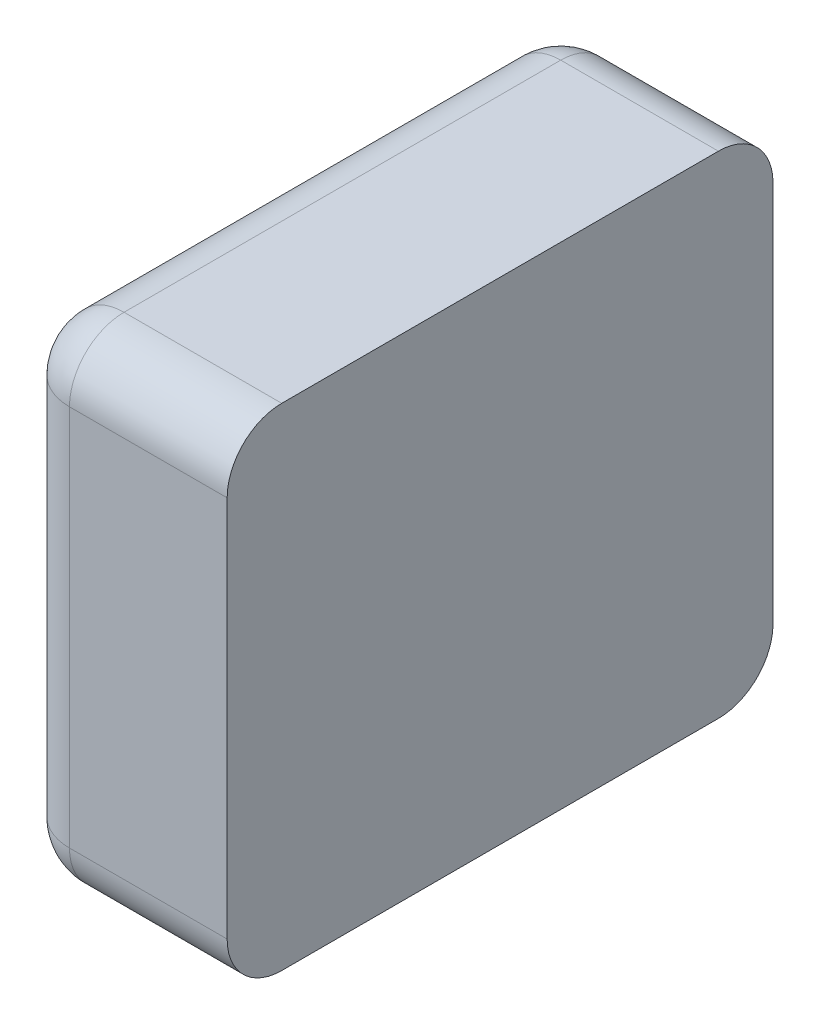
ISO-10303-21;
HEADER;
FILE_DESCRIPTION(('STEP AP214'),'2;1');
FILE_NAME('part.step','',(''),(''),'','','');
FILE_SCHEMA(('AUTOMOTIVE_DESIGN { 1 0 10303 214 1 1 1 1 }'));
ENDSEC;
DATA;
#1=APPLICATION_CONTEXT('core data for automotive mechanical design processes');
#2=APPLICATION_PROTOCOL_DEFINITION('international standard','automotive_design',2000,#1);
#3=PRODUCT_CONTEXT('',#1,'mechanical');
#4=PRODUCT('Part','Part','',(#3));
#5=PRODUCT_RELATED_PRODUCT_CATEGORY('part','',(#4));
#6=PRODUCT_DEFINITION_FORMATION('','',#4);
#7=PRODUCT_DEFINITION_CONTEXT('part definition',#1,'design');
#8=PRODUCT_DEFINITION('design','',#6,#7);
#9=PRODUCT_DEFINITION_SHAPE('','',#8);
#10=(LENGTH_UNIT() NAMED_UNIT(*) SI_UNIT(.MILLI.,.METRE.));
#11=(NAMED_UNIT(*) PLANE_ANGLE_UNIT() SI_UNIT($,.RADIAN.));
#12=(NAMED_UNIT(*) SI_UNIT($,.STERADIAN.) SOLID_ANGLE_UNIT());
#13=UNCERTAINTY_MEASURE_WITH_UNIT(LENGTH_MEASURE(1.E-05),#10,'distance_accuracy_value','');
#14=(GEOMETRIC_REPRESENTATION_CONTEXT(3) GLOBAL_UNCERTAINTY_ASSIGNED_CONTEXT((#13)) GLOBAL_UNIT_ASSIGNED_CONTEXT((#10,
#11,#12)) REPRESENTATION_CONTEXT('',''));
#15=CARTESIAN_POINT('',(0.,0.,0.));
#16=DIRECTION('',(0.,0.,1.));
#17=DIRECTION('',(1.,0.,0.));
#18=AXIS2_PLACEMENT_3D('',#15,#16,#17);
#19=CARTESIAN_POINT('',(-0.8,-0.405,0.));
#20=DIRECTION('',(1.,0.,0.));
#21=DIRECTION('',(0.,0.,1.));
#22=AXIS2_PLACEMENT_3D('',#19,#20,#21);
#23=PLANE('',#22);
#24=DIRECTION('',(0.,1.,0.));
#25=VECTOR('',#24,1.);
#26=CARTESIAN_POINT('',(-0.8,-0.405,0.81));
#27=LINE('',#26,#25);
#28=CARTESIAN_POINT('',(-0.8,-0.315,0.81));
#29=VERTEX_POINT('',#28);
#30=CARTESIAN_POINT('',(-0.8,0.315,0.81));
#31=VERTEX_POINT('',#30);
#32=EDGE_CURVE('E11',#29,#31,#27,.T.);
#33=ORIENTED_EDGE('',*,*,#32,.T.);
#34=DIRECTION('',(0.,0.,1.));
#35=VECTOR('',#34,1.);
#36=CARTESIAN_POINT('',(-0.8,0.315,0.));
#37=LINE('',#36,#35);
#38=CARTESIAN_POINT('',(-0.8,0.315,0.09));
#39=VERTEX_POINT('',#38);
#40=EDGE_CURVE('E24',#39,#31,#37,.T.);
#41=ORIENTED_EDGE('',*,*,#40,.F.);
#42=DIRECTION('',(0.,1.,0.));
#43=VECTOR('',#42,1.);
#44=CARTESIAN_POINT('',(-0.8,-0.405,0.09));
#45=LINE('',#44,#43);
#46=CARTESIAN_POINT('',(-0.8,-0.315,0.09));
#47=VERTEX_POINT('',#46);
#48=EDGE_CURVE('E192',#47,#39,#45,.T.);
#49=ORIENTED_EDGE('',*,*,#48,.F.);
#50=DIRECTION('',(0.,0.,1.));
#51=VECTOR('',#50,1.);
#52=CARTESIAN_POINT('',(-0.8,-0.315,0.));
#53=LINE('',#52,#51);
#54=EDGE_CURVE('E36',#47,#29,#53,.T.);
#55=ORIENTED_EDGE('',*,*,#54,.T.);
#56=EDGE_LOOP('',(#33,#41,#49,#55));
#57=FACE_BOUND('',#56,.T.);
#58=ADVANCED_FACE('F17',(#57),#23,.F.);
#59=CARTESIAN_POINT('',(-0.71,-0.315,0.));
#60=DIRECTION('',(0.,0.,1.));
#61=DIRECTION('',(-1.,0.,0.));
#62=AXIS2_PLACEMENT_3D('',#59,#60,#61);
#63=CYLINDRICAL_SURFACE('',#62,0.09);
#64=ORIENTED_EDGE('',*,*,#54,.F.);
#65=CARTESIAN_POINT('',(-0.71,-0.315,0.09));
#66=DIRECTION('',(0.,0.,1.));
#67=DIRECTION('',(-1.,0.,0.));
#68=AXIS2_PLACEMENT_3D('',#65,#66,#67);
#69=CIRCLE('',#68,0.09);
#70=CARTESIAN_POINT('',(-0.71,-0.405,0.09));
#71=VERTEX_POINT('',#70);
#72=EDGE_CURVE('E189',#47,#71,#69,.T.);
#73=ORIENTED_EDGE('',*,*,#72,.T.);
#74=DIRECTION('',(0.,0.,1.));
#75=VECTOR('',#74,1.);
#76=CARTESIAN_POINT('',(-0.71,-0.405,0.));
#77=LINE('',#76,#75);
#78=CARTESIAN_POINT('',(-0.71,-0.405,0.81));
#79=VERTEX_POINT('',#78);
#80=EDGE_CURVE('E187',#71,#79,#77,.T.);
#81=ORIENTED_EDGE('',*,*,#80,.T.);
#82=CARTESIAN_POINT('',(-0.71,-0.315,0.81));
#83=DIRECTION('',(0.,0.,1.));
#84=DIRECTION('',(-1.,0.,0.));
#85=AXIS2_PLACEMENT_3D('',#82,#83,#84);
#86=CIRCLE('',#85,0.09);
#87=EDGE_CURVE('E184',#29,#79,#86,.T.);
#88=ORIENTED_EDGE('',*,*,#87,.F.);
#89=EDGE_LOOP('',(#64,#73,#81,#88));
#90=FACE_BOUND('',#89,.T.);
#91=ADVANCED_FACE('F238',(#90),#63,.T.);
#92=CARTESIAN_POINT('',(-0.71,-0.405,0.09));
#93=DIRECTION('',(0.,1.,0.));
#94=DIRECTION('',(-1.,0.,0.));
#95=AXIS2_PLACEMENT_3D('',#92,#93,#94);
#96=CYLINDRICAL_SURFACE('',#95,0.09);
#97=ORIENTED_EDGE('',*,*,#48,.T.);
#98=CARTESIAN_POINT('',(-0.71,0.315,0.09));
#99=DIRECTION('',(0.,1.,0.));
#100=DIRECTION('',(-1.,0.,0.));
#101=AXIS2_PLACEMENT_3D('',#98,#99,#100);
#102=CIRCLE('',#101,0.09);
#103=CARTESIAN_POINT('',(-0.71,0.315,0.));
#104=VERTEX_POINT('',#103);
#105=EDGE_CURVE('E181',#104,#39,#102,.T.);
#106=ORIENTED_EDGE('',*,*,#105,.F.);
#107=DIRECTION('',(0.,1.,0.));
#108=VECTOR('',#107,1.);
#109=CARTESIAN_POINT('',(-0.71,-0.405,0.));
#110=LINE('',#109,#108);
#111=CARTESIAN_POINT('',(-0.71,-0.315,0.));
#112=VERTEX_POINT('',#111);
#113=EDGE_CURVE('E178',#112,#104,#110,.T.);
#114=ORIENTED_EDGE('',*,*,#113,.F.);
#115=CARTESIAN_POINT('',(-0.71,-0.315,0.09));
#116=DIRECTION('',(0.,1.,0.));
#117=DIRECTION('',(-1.,0.,0.));
#118=AXIS2_PLACEMENT_3D('',#115,#116,#117);
#119=CIRCLE('',#118,0.09);
#120=EDGE_CURVE('E175',#112,#47,#119,.T.);
#121=ORIENTED_EDGE('',*,*,#120,.T.);
#122=EDGE_LOOP('',(#97,#106,#114,#121));
#123=FACE_BOUND('',#122,.T.);
#124=ADVANCED_FACE('F194',(#123),#96,.T.);
#125=CARTESIAN_POINT('',(-0.71,-0.405,0.81));
#126=DIRECTION('',(0.,1.,0.));
#127=DIRECTION('',(-1.,0.,0.));
#128=AXIS2_PLACEMENT_3D('',#125,#126,#127);
#129=CYLINDRICAL_SURFACE('',#128,0.09);
#130=CARTESIAN_POINT('',(-0.71,-0.315,0.81));
#131=DIRECTION('',(0.,-1.,0.));
#132=DIRECTION('',(-1.,0.,0.));
#133=AXIS2_PLACEMENT_3D('',#130,#131,#132);
#134=CIRCLE('',#133,0.09);
#135=CARTESIAN_POINT('',(-0.71,-0.315,0.9));
#136=VERTEX_POINT('',#135);
#137=EDGE_CURVE('E172',#136,#29,#134,.T.);
#138=ORIENTED_EDGE('',*,*,#137,.F.);
#139=DIRECTION('',(0.,1.,0.));
#140=VECTOR('',#139,1.);
#141=CARTESIAN_POINT('',(-0.71,-0.405,0.9));
#142=LINE('',#141,#140);
#143=CARTESIAN_POINT('',(-0.71,0.315,0.9));
#144=VERTEX_POINT('',#143);
#145=EDGE_CURVE('E170',#136,#144,#142,.T.);
#146=ORIENTED_EDGE('',*,*,#145,.T.);
#147=CARTESIAN_POINT('',(-0.71,0.315,0.81));
#148=DIRECTION('',(0.,1.,0.));
#149=DIRECTION('',(-1.,0.,0.));
#150=AXIS2_PLACEMENT_3D('',#147,#148,#149);
#151=CIRCLE('',#150,0.09);
#152=EDGE_CURVE('E167',#31,#144,#151,.T.);
#153=ORIENTED_EDGE('',*,*,#152,.F.);
#154=ORIENTED_EDGE('',*,*,#32,.F.);
#155=EDGE_LOOP('',(#138,#146,#153,#154));
#156=FACE_BOUND('',#155,.T.);
#157=ADVANCED_FACE('F246',(#156),#129,.T.);
#158=CARTESIAN_POINT('',(-0.71,0.315,0.));
#159=DIRECTION('',(0.,0.,1.));
#160=DIRECTION('',(-1.,0.,0.));
#161=AXIS2_PLACEMENT_3D('',#158,#159,#160);
#162=CYLINDRICAL_SURFACE('',#161,0.09);
#163=CARTESIAN_POINT('',(-0.71,0.315,0.81));
#164=DIRECTION('',(0.,0.,1.));
#165=DIRECTION('',(-1.,0.,0.));
#166=AXIS2_PLACEMENT_3D('',#163,#164,#165);
#167=CIRCLE('',#166,0.09);
#168=CARTESIAN_POINT('',(-0.71,0.405,0.81));
#169=VERTEX_POINT('',#168);
#170=EDGE_CURVE('E164',#169,#31,#167,.T.);
#171=ORIENTED_EDGE('',*,*,#170,.F.);
#172=DIRECTION('',(0.,0.,1.));
#173=VECTOR('',#172,1.);
#174=CARTESIAN_POINT('',(-0.71,0.405,0.));
#175=LINE('',#174,#173);
#176=CARTESIAN_POINT('',(-0.71,0.405,0.09));
#177=VERTEX_POINT('',#176);
#178=EDGE_CURVE('E109',#177,#169,#175,.T.);
#179=ORIENTED_EDGE('',*,*,#178,.F.);
#180=CARTESIAN_POINT('',(-0.71,0.315,0.09));
#181=DIRECTION('',(0.,0.,-1.));
#182=DIRECTION('',(-1.,0.,0.));
#183=AXIS2_PLACEMENT_3D('',#180,#181,#182);
#184=CIRCLE('',#183,0.09);
#185=EDGE_CURVE('E160',#39,#177,#184,.T.);
#186=ORIENTED_EDGE('',*,*,#185,.F.);
#187=ORIENTED_EDGE('',*,*,#40,.T.);
#188=EDGE_LOOP('',(#171,#179,#186,#187));
#189=FACE_BOUND('',#188,.T.);
#190=ADVANCED_FACE('F201',(#189),#162,.T.);
#191=CARTESIAN_POINT('',(-0.71,-0.315,0.09));
#192=DIRECTION('',(0.,0.,1.));
#193=DIRECTION('',(-1.,0.,0.));
#194=AXIS2_PLACEMENT_3D('',#191,#192,#193);
#195=SPHERICAL_SURFACE('',#194,0.09);
#196=ORIENTED_EDGE('',*,*,#120,.F.);
#197=CARTESIAN_POINT('',(-0.71,-0.315,0.09));
#198=DIRECTION('',(-1.,0.,0.));
#199=DIRECTION('',(0.,-1.,0.));
#200=AXIS2_PLACEMENT_3D('',#197,#198,#199);
#201=CIRCLE('',#200,0.09);
#202=EDGE_CURVE('E157',#112,#71,#201,.T.);
#203=ORIENTED_EDGE('',*,*,#202,.T.);
#204=ORIENTED_EDGE('',*,*,#72,.F.);
#205=EDGE_LOOP('',(#196,#203,#204));
#206=FACE_BOUND('',#205,.T.);
#207=ADVANCED_FACE('F253',(#206),#195,.T.);
#208=CARTESIAN_POINT('',(-0.71,-0.315,0.81));
#209=DIRECTION('',(0.,0.,-1.));
#210=DIRECTION('',(-1.,0.,0.));
#211=AXIS2_PLACEMENT_3D('',#208,#209,#210);
#212=SPHERICAL_SURFACE('',#211,0.09);
#213=ORIENTED_EDGE('',*,*,#87,.T.);
#214=CARTESIAN_POINT('',(-0.71,-0.315,0.81));
#215=DIRECTION('',(1.,0.,0.));
#216=DIRECTION('',(0.,-1.,0.));
#217=AXIS2_PLACEMENT_3D('',#214,#215,#216);
#218=CIRCLE('',#217,0.09);
#219=EDGE_CURVE('E154',#136,#79,#218,.T.);
#220=ORIENTED_EDGE('',*,*,#219,.F.);
#221=ORIENTED_EDGE('',*,*,#137,.T.);
#222=EDGE_LOOP('',(#213,#220,#221));
#223=FACE_BOUND('',#222,.T.);
#224=ADVANCED_FACE('F256',(#223),#212,.T.);
#225=CARTESIAN_POINT('',(-0.8,-0.405,0.));
#226=DIRECTION('',(0.,1.,0.));
#227=DIRECTION('',(0.,0.,1.));
#228=AXIS2_PLACEMENT_3D('',#225,#226,#227);
#229=PLANE('',#228);
#230=DIRECTION('',(1.,0.,0.));
#231=VECTOR('',#230,1.);
#232=CARTESIAN_POINT('',(-0.8,-0.405,0.81));
#233=LINE('',#232,#231);
#234=CARTESIAN_POINT('',(-0.45,-0.405,0.81));
#235=VERTEX_POINT('',#234);
#236=EDGE_CURVE('E151',#79,#235,#233,.T.);
#237=ORIENTED_EDGE('',*,*,#236,.F.);
#238=ORIENTED_EDGE('',*,*,#80,.F.);
#239=DIRECTION('',(1.,0.,0.));
#240=VECTOR('',#239,1.);
#241=CARTESIAN_POINT('',(-0.8,-0.405,0.09));
#242=LINE('',#241,#240);
#243=CARTESIAN_POINT('',(-0.45,-0.405,0.09));
#244=VERTEX_POINT('',#243);
#245=EDGE_CURVE('E148',#71,#244,#242,.T.);
#246=ORIENTED_EDGE('',*,*,#245,.T.);
#247=DIRECTION('',(0.,0.,1.));
#248=VECTOR('',#247,1.);
#249=CARTESIAN_POINT('',(-0.45,-0.405,0.));
#250=LINE('',#249,#248);
#251=EDGE_CURVE('E146',#244,#235,#250,.T.);
#252=ORIENTED_EDGE('',*,*,#251,.T.);
#253=EDGE_LOOP('',(#237,#238,#246,#252));
#254=FACE_BOUND('',#253,.T.);
#255=ADVANCED_FACE('F216',(#254),#229,.F.);
#256=CARTESIAN_POINT('',(-0.8,-0.405,0.));
#257=DIRECTION('',(0.,0.,1.));
#258=DIRECTION('',(1.,0.,0.));
#259=AXIS2_PLACEMENT_3D('',#256,#257,#258);
#260=PLANE('',#259);
#261=DIRECTION('',(1.,0.,0.));
#262=VECTOR('',#261,1.);
#263=CARTESIAN_POINT('',(-0.8,-0.315,0.));
#264=LINE('',#263,#262);
#265=CARTESIAN_POINT('',(-0.45,-0.315,0.));
#266=VERTEX_POINT('',#265);
#267=EDGE_CURVE('E143',#112,#266,#264,.T.);
#268=ORIENTED_EDGE('',*,*,#267,.F.);
#269=ORIENTED_EDGE('',*,*,#113,.T.);
#270=DIRECTION('',(1.,0.,0.));
#271=VECTOR('',#270,1.);
#272=CARTESIAN_POINT('',(-0.8,0.315,0.));
#273=LINE('',#272,#271);
#274=CARTESIAN_POINT('',(-0.45,0.315,0.));
#275=VERTEX_POINT('',#274);
#276=EDGE_CURVE('E140',#104,#275,#273,.T.);
#277=ORIENTED_EDGE('',*,*,#276,.T.);
#278=DIRECTION('',(0.,1.,0.));
#279=VECTOR('',#278,1.);
#280=CARTESIAN_POINT('',(-0.45,-0.405,0.));
#281=LINE('',#280,#279);
#282=EDGE_CURVE('E138',#266,#275,#281,.T.);
#283=ORIENTED_EDGE('',*,*,#282,.F.);
#284=EDGE_LOOP('',(#268,#269,#277,#283));
#285=FACE_BOUND('',#284,.T.);
#286=ADVANCED_FACE('F225',(#285),#260,.F.);
#287=CARTESIAN_POINT('',(-0.71,0.315,0.09));
#288=DIRECTION('',(0.,0.,1.));
#289=DIRECTION('',(-1.,0.,0.));
#290=AXIS2_PLACEMENT_3D('',#287,#288,#289);
#291=SPHERICAL_SURFACE('',#290,0.09);
#292=ORIENTED_EDGE('',*,*,#185,.T.);
#293=CARTESIAN_POINT('',(-0.71,0.315,0.09));
#294=DIRECTION('',(1.,0.,0.));
#295=DIRECTION('',(0.,1.,0.));
#296=AXIS2_PLACEMENT_3D('',#293,#294,#295);
#297=CIRCLE('',#296,0.09);
#298=EDGE_CURVE('E135',#104,#177,#297,.T.);
#299=ORIENTED_EDGE('',*,*,#298,.F.);
#300=ORIENTED_EDGE('',*,*,#105,.T.);
#301=EDGE_LOOP('',(#292,#299,#300));
#302=FACE_BOUND('',#301,.T.);
#303=ADVANCED_FACE('F200',(#302),#291,.T.);
#304=CARTESIAN_POINT('',(-0.8,-0.405,0.9));
#305=DIRECTION('',(0.,0.,1.));
#306=DIRECTION('',(1.,0.,0.));
#307=AXIS2_PLACEMENT_3D('',#304,#305,#306);
#308=PLANE('',#307);
#309=DIRECTION('',(0.,1.,0.));
#310=VECTOR('',#309,1.);
#311=CARTESIAN_POINT('',(-0.45,-0.405,0.9));
#312=LINE('',#311,#310);
#313=CARTESIAN_POINT('',(-0.45,-0.315,0.9));
#314=VERTEX_POINT('',#313);
#315=CARTESIAN_POINT('',(-0.45,0.315,0.9));
#316=VERTEX_POINT('',#315);
#317=EDGE_CURVE('E133',#314,#316,#312,.T.);
#318=ORIENTED_EDGE('',*,*,#317,.T.);
#319=DIRECTION('',(1.,0.,0.));
#320=VECTOR('',#319,1.);
#321=CARTESIAN_POINT('',(-0.8,0.315,0.9));
#322=LINE('',#321,#320);
#323=EDGE_CURVE('E118',#144,#316,#322,.T.);
#324=ORIENTED_EDGE('',*,*,#323,.F.);
#325=ORIENTED_EDGE('',*,*,#145,.F.);
#326=DIRECTION('',(1.,0.,0.));
#327=VECTOR('',#326,1.);
#328=CARTESIAN_POINT('',(-0.8,-0.315,0.9));
#329=LINE('',#328,#327);
#330=EDGE_CURVE('E129',#136,#314,#329,.T.);
#331=ORIENTED_EDGE('',*,*,#330,.T.);
#332=EDGE_LOOP('',(#318,#324,#325,#331));
#333=FACE_BOUND('',#332,.T.);
#334=ADVANCED_FACE('F207',(#333),#308,.T.);
#335=CARTESIAN_POINT('',(-0.71,0.315,0.81));
#336=DIRECTION('',(0.,-1.,0.));
#337=DIRECTION('',(-1.,0.,0.));
#338=AXIS2_PLACEMENT_3D('',#335,#336,#337);
#339=SPHERICAL_SURFACE('',#338,0.09);
#340=ORIENTED_EDGE('',*,*,#152,.T.);
#341=CARTESIAN_POINT('',(-0.71,0.315,0.81));
#342=DIRECTION('',(1.,0.,0.));
#343=DIRECTION('',(0.,0.,1.));
#344=AXIS2_PLACEMENT_3D('',#341,#342,#343);
#345=CIRCLE('',#344,0.09);
#346=EDGE_CURVE('E102',#169,#144,#345,.T.);
#347=ORIENTED_EDGE('',*,*,#346,.F.);
#348=ORIENTED_EDGE('',*,*,#170,.T.);
#349=EDGE_LOOP('',(#340,#347,#348));
#350=FACE_BOUND('',#349,.T.);
#351=ADVANCED_FACE('F203',(#350),#339,.T.);
#352=CARTESIAN_POINT('',(-0.8,0.405,0.));
#353=DIRECTION('',(0.,1.,0.));
#354=DIRECTION('',(0.,0.,1.));
#355=AXIS2_PLACEMENT_3D('',#352,#353,#354);
#356=PLANE('',#355);
#357=DIRECTION('',(0.,0.,1.));
#358=VECTOR('',#357,1.);
#359=CARTESIAN_POINT('',(-0.45,0.405,0.));
#360=LINE('',#359,#358);
#361=CARTESIAN_POINT('',(-0.45,0.405,0.09));
#362=VERTEX_POINT('',#361);
#363=CARTESIAN_POINT('',(-0.45,0.405,0.81));
#364=VERTEX_POINT('',#363);
#365=EDGE_CURVE('E92',#362,#364,#360,.T.);
#366=ORIENTED_EDGE('',*,*,#365,.F.);
#367=DIRECTION('',(1.,0.,0.));
#368=VECTOR('',#367,1.);
#369=CARTESIAN_POINT('',(-0.8,0.405,0.09));
#370=LINE('',#369,#368);
#371=EDGE_CURVE('E103',#177,#362,#370,.T.);
#372=ORIENTED_EDGE('',*,*,#371,.F.);
#373=ORIENTED_EDGE('',*,*,#178,.T.);
#374=DIRECTION('',(1.,0.,0.));
#375=VECTOR('',#374,1.);
#376=CARTESIAN_POINT('',(-0.8,0.405,0.81));
#377=LINE('',#376,#375);
#378=EDGE_CURVE('E107',#169,#364,#377,.T.);
#379=ORIENTED_EDGE('',*,*,#378,.T.);
#380=EDGE_LOOP('',(#366,#372,#373,#379));
#381=FACE_BOUND('',#380,.T.);
#382=ADVANCED_FACE('F108',(#381),#356,.T.);
#383=CARTESIAN_POINT('',(-0.8,-0.315,0.09));
#384=DIRECTION('',(1.,0.,0.));
#385=DIRECTION('',(0.,-1.,0.));
#386=AXIS2_PLACEMENT_3D('',#383,#384,#385);
#387=CYLINDRICAL_SURFACE('',#386,0.09);
#388=ORIENTED_EDGE('',*,*,#202,.F.);
#389=ORIENTED_EDGE('',*,*,#267,.T.);
#390=CARTESIAN_POINT('',(-0.45,-0.315,0.09));
#391=DIRECTION('',(1.,0.,0.));
#392=DIRECTION('',(0.,0.,1.));
#393=AXIS2_PLACEMENT_3D('',#390,#391,#392);
#394=CIRCLE('',#393,0.09);
#395=EDGE_CURVE('E113',#244,#266,#394,.T.);
#396=ORIENTED_EDGE('',*,*,#395,.F.);
#397=ORIENTED_EDGE('',*,*,#245,.F.);
#398=EDGE_LOOP('',(#388,#389,#396,#397));
#399=FACE_BOUND('',#398,.T.);
#400=ADVANCED_FACE('F221',(#399),#387,.T.);
#401=CARTESIAN_POINT('',(-0.8,-0.315,0.81));
#402=DIRECTION('',(1.,0.,0.));
#403=DIRECTION('',(0.,-1.,0.));
#404=AXIS2_PLACEMENT_3D('',#401,#402,#403);
#405=CYLINDRICAL_SURFACE('',#404,0.09);
#406=ORIENTED_EDGE('',*,*,#236,.T.);
#407=CARTESIAN_POINT('',(-0.45,-0.315,0.81));
#408=DIRECTION('',(-1.,0.,0.));
#409=DIRECTION('',(0.,0.,1.));
#410=AXIS2_PLACEMENT_3D('',#407,#408,#409);
#411=CIRCLE('',#410,0.09);
#412=EDGE_CURVE('E120',#235,#314,#411,.T.);
#413=ORIENTED_EDGE('',*,*,#412,.T.);
#414=ORIENTED_EDGE('',*,*,#330,.F.);
#415=ORIENTED_EDGE('',*,*,#219,.T.);
#416=EDGE_LOOP('',(#406,#413,#414,#415));
#417=FACE_BOUND('',#416,.T.);
#418=ADVANCED_FACE('F212',(#417),#405,.T.);
#419=CARTESIAN_POINT('',(-0.45,-0.405,0.));
#420=DIRECTION('',(1.,0.,0.));
#421=DIRECTION('',(0.,0.,1.));
#422=AXIS2_PLACEMENT_3D('',#419,#420,#421);
#423=PLANE('',#422);
#424=ORIENTED_EDGE('',*,*,#251,.F.);
#425=ORIENTED_EDGE('',*,*,#395,.T.);
#426=ORIENTED_EDGE('',*,*,#282,.T.);
#427=CARTESIAN_POINT('',(-0.45,0.315,0.09));
#428=DIRECTION('',(-1.,0.,0.));
#429=DIRECTION('',(0.,0.,1.));
#430=AXIS2_PLACEMENT_3D('',#427,#428,#429);
#431=CIRCLE('',#430,0.09);
#432=EDGE_CURVE('E98',#362,#275,#431,.T.);
#433=ORIENTED_EDGE('',*,*,#432,.F.);
#434=ORIENTED_EDGE('',*,*,#365,.T.);
#435=CARTESIAN_POINT('',(-0.45,0.315,0.81));
#436=DIRECTION('',(1.,0.,0.));
#437=DIRECTION('',(0.,0.,1.));
#438=AXIS2_PLACEMENT_3D('',#435,#436,#437);
#439=CIRCLE('',#438,0.09);
#440=EDGE_CURVE('E96',#364,#316,#439,.T.);
#441=ORIENTED_EDGE('',*,*,#440,.T.);
#442=ORIENTED_EDGE('',*,*,#317,.F.);
#443=ORIENTED_EDGE('',*,*,#412,.F.);
#444=EDGE_LOOP('',(#424,#425,#426,#433,#434,#441,#442,#443));
#445=FACE_BOUND('',#444,.T.);
#446=ADVANCED_FACE('F94',(#445),#423,.T.);
#447=CARTESIAN_POINT('',(-0.8,0.315,0.09));
#448=DIRECTION('',(1.,0.,0.));
#449=DIRECTION('',(0.,1.,0.));
#450=AXIS2_PLACEMENT_3D('',#447,#448,#449);
#451=CYLINDRICAL_SURFACE('',#450,0.09);
#452=ORIENTED_EDGE('',*,*,#371,.T.);
#453=ORIENTED_EDGE('',*,*,#432,.T.);
#454=ORIENTED_EDGE('',*,*,#276,.F.);
#455=ORIENTED_EDGE('',*,*,#298,.T.);
#456=EDGE_LOOP('',(#452,#453,#454,#455));
#457=FACE_BOUND('',#456,.T.);
#458=ADVANCED_FACE('F227',(#457),#451,.T.);
#459=CARTESIAN_POINT('',(-0.8,0.315,0.81));
#460=DIRECTION('',(1.,0.,0.));
#461=DIRECTION('',(0.,1.,0.));
#462=AXIS2_PLACEMENT_3D('',#459,#460,#461);
#463=CYLINDRICAL_SURFACE('',#462,0.09);
#464=ORIENTED_EDGE('',*,*,#346,.T.);
#465=ORIENTED_EDGE('',*,*,#323,.T.);
#466=ORIENTED_EDGE('',*,*,#440,.F.);
#467=ORIENTED_EDGE('',*,*,#378,.F.);
#468=EDGE_LOOP('',(#464,#465,#466,#467));
#469=FACE_BOUND('',#468,.T.);
#470=ADVANCED_FACE('F116',(#469),#463,.T.);
#471=CLOSED_SHELL('',(#58,#91,#124,#157,#190,#207,#224,#255,#286,#303,#334,#351,#382,#400,#418,
#446,#458,#470));
#472=MANIFOLD_SOLID_BREP('B1',#471);
#473=ADVANCED_BREP_SHAPE_REPRESENTATION('',(#18,#472),#14);
#474=SHAPE_DEFINITION_REPRESENTATION(#9,#473);
ENDSEC;
END-ISO-10303-21;
